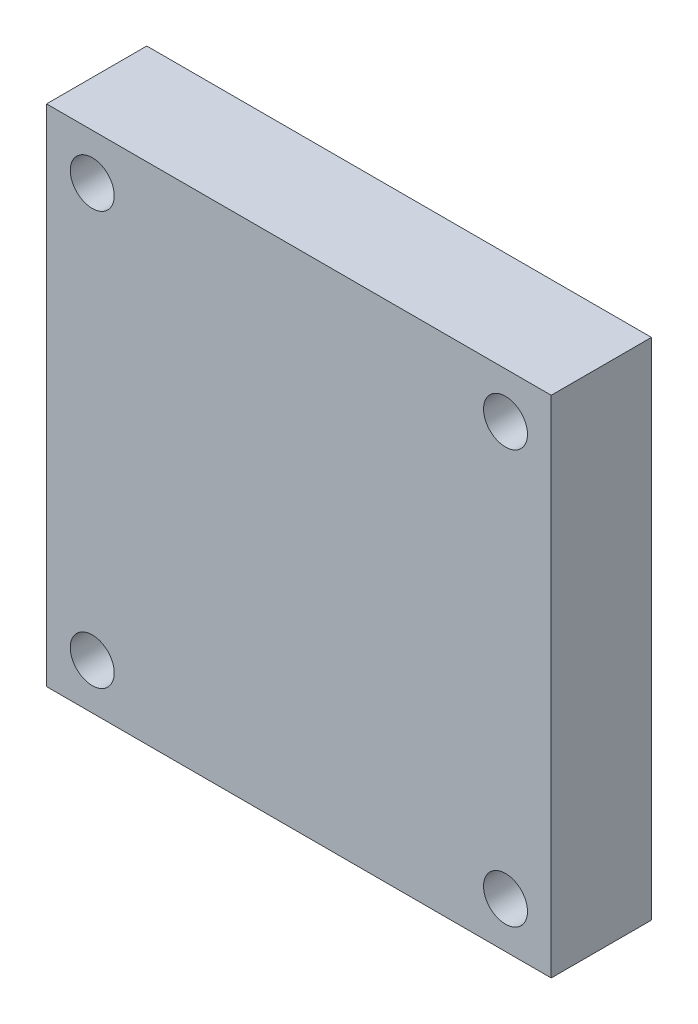
ISO-10303-21;
HEADER;
FILE_DESCRIPTION(('STEP AP214'),'2;1');
FILE_NAME('part.step','',(''),(''),'','','');
FILE_SCHEMA(('AUTOMOTIVE_DESIGN { 1 0 10303 214 1 1 1 1 }'));
ENDSEC;
DATA;
#1=APPLICATION_CONTEXT('core data for automotive mechanical design processes');
#2=APPLICATION_PROTOCOL_DEFINITION('international standard','automotive_design',2000,#1);
#3=PRODUCT_CONTEXT('',#1,'mechanical');
#4=PRODUCT('Part','Part','',(#3));
#5=PRODUCT_RELATED_PRODUCT_CATEGORY('part','',(#4));
#6=PRODUCT_DEFINITION_FORMATION('','',#4);
#7=PRODUCT_DEFINITION_CONTEXT('part definition',#1,'design');
#8=PRODUCT_DEFINITION('design','',#6,#7);
#9=PRODUCT_DEFINITION_SHAPE('','',#8);
#10=(LENGTH_UNIT() NAMED_UNIT(*) SI_UNIT(.MILLI.,.METRE.));
#11=(NAMED_UNIT(*) PLANE_ANGLE_UNIT() SI_UNIT($,.RADIAN.));
#12=(NAMED_UNIT(*) SI_UNIT($,.STERADIAN.) SOLID_ANGLE_UNIT());
#13=UNCERTAINTY_MEASURE_WITH_UNIT(LENGTH_MEASURE(1.E-05),#10,'distance_accuracy_value','');
#14=(GEOMETRIC_REPRESENTATION_CONTEXT(3) GLOBAL_UNCERTAINTY_ASSIGNED_CONTEXT((#13)) GLOBAL_UNIT_ASSIGNED_CONTEXT((#10,
#11,#12)) REPRESENTATION_CONTEXT('',''));
#15=CARTESIAN_POINT('',(0.,0.,0.));
#16=DIRECTION('',(0.,0.,1.));
#17=DIRECTION('',(1.,0.,0.));
#18=AXIS2_PLACEMENT_3D('',#15,#16,#17);
#19=CARTESIAN_POINT('',(28.7,0.,11.4));
#20=DIRECTION('',(-1.,0.,0.));
#21=DIRECTION('',(0.,-1.,0.));
#22=AXIS2_PLACEMENT_3D('',#19,#20,#21);
#23=PLANE('',#22);
#24=DIRECTION('',(0.,1.,0.));
#25=VECTOR('',#24,1.);
#26=CARTESIAN_POINT('',(28.7,0.,0.));
#27=LINE('',#26,#25);
#28=CARTESIAN_POINT('',(28.7,-28.7,0.));
#29=VERTEX_POINT('',#28);
#30=CARTESIAN_POINT('',(28.7,28.7,0.));
#31=VERTEX_POINT('',#30);
#32=EDGE_CURVE('E95',#29,#31,#27,.T.);
#33=ORIENTED_EDGE('',*,*,#32,.T.);
#34=DIRECTION('',(0.,0.,-1.));
#35=VECTOR('',#34,1.);
#36=CARTESIAN_POINT('',(28.7,28.7,11.4));
#37=LINE('',#36,#35);
#38=CARTESIAN_POINT('',(28.7,28.7,11.4));
#39=VERTEX_POINT('',#38);
#40=EDGE_CURVE('E11',#39,#31,#37,.T.);
#41=ORIENTED_EDGE('',*,*,#40,.F.);
#42=DIRECTION('',(0.,1.,0.));
#43=VECTOR('',#42,1.);
#44=CARTESIAN_POINT('',(28.7,0.,11.4));
#45=LINE('',#44,#43);
#46=CARTESIAN_POINT('',(28.7,-28.7,11.4));
#47=VERTEX_POINT('',#46);
#48=EDGE_CURVE('E83',#47,#39,#45,.T.);
#49=ORIENTED_EDGE('',*,*,#48,.F.);
#50=DIRECTION('',(0.,0.,-1.));
#51=VECTOR('',#50,1.);
#52=CARTESIAN_POINT('',(28.7,-28.7,11.4));
#53=LINE('',#52,#51);
#54=EDGE_CURVE('E91',#47,#29,#53,.T.);
#55=ORIENTED_EDGE('',*,*,#54,.T.);
#56=EDGE_LOOP('',(#33,#41,#49,#55));
#57=FACE_BOUND('',#56,.T.);
#58=ADVANCED_FACE('F32',(#57),#23,.F.);
#59=CARTESIAN_POINT('',(0.,28.7,11.4));
#60=DIRECTION('',(0.,-1.,0.));
#61=DIRECTION('',(1.,0.,0.));
#62=AXIS2_PLACEMENT_3D('',#59,#60,#61);
#63=PLANE('',#62);
#64=DIRECTION('',(-1.,0.,0.));
#65=VECTOR('',#64,1.);
#66=CARTESIAN_POINT('',(0.,28.7,0.));
#67=LINE('',#66,#65);
#68=CARTESIAN_POINT('',(-28.7,28.7,0.));
#69=VERTEX_POINT('',#68);
#70=EDGE_CURVE('E87',#31,#69,#67,.T.);
#71=ORIENTED_EDGE('',*,*,#70,.T.);
#72=DIRECTION('',(0.,0.,-1.));
#73=VECTOR('',#72,1.);
#74=CARTESIAN_POINT('',(-28.7,28.7,11.4));
#75=LINE('',#74,#73);
#76=CARTESIAN_POINT('',(-28.7,28.7,11.4));
#77=VERTEX_POINT('',#76);
#78=EDGE_CURVE('E40',#77,#69,#75,.T.);
#79=ORIENTED_EDGE('',*,*,#78,.F.);
#80=DIRECTION('',(-1.,0.,0.));
#81=VECTOR('',#80,1.);
#82=CARTESIAN_POINT('',(0.,28.7,11.4));
#83=LINE('',#82,#81);
#84=EDGE_CURVE('E78',#39,#77,#83,.T.);
#85=ORIENTED_EDGE('',*,*,#84,.F.);
#86=ORIENTED_EDGE('',*,*,#40,.T.);
#87=EDGE_LOOP('',(#71,#79,#85,#86));
#88=FACE_BOUND('',#87,.T.);
#89=ADVANCED_FACE('F86',(#88),#63,.F.);
#90=CARTESIAN_POINT('',(-28.7,0.,11.4));
#91=DIRECTION('',(1.,0.,0.));
#92=DIRECTION('',(0.,0.,-1.));
#93=AXIS2_PLACEMENT_3D('',#90,#91,#92);
#94=PLANE('',#93);
#95=DIRECTION('',(0.,-1.,0.));
#96=VECTOR('',#95,1.);
#97=CARTESIAN_POINT('',(-28.7,0.,0.));
#98=LINE('',#97,#96);
#99=CARTESIAN_POINT('',(-28.7,-28.7,0.));
#100=VERTEX_POINT('',#99);
#101=EDGE_CURVE('E65',#69,#100,#98,.T.);
#102=ORIENTED_EDGE('',*,*,#101,.T.);
#103=DIRECTION('',(0.,0.,-1.));
#104=VECTOR('',#103,1.);
#105=CARTESIAN_POINT('',(-28.7,-28.7,11.4));
#106=LINE('',#105,#104);
#107=CARTESIAN_POINT('',(-28.7,-28.7,11.4));
#108=VERTEX_POINT('',#107);
#109=EDGE_CURVE('E88',#108,#100,#106,.T.);
#110=ORIENTED_EDGE('',*,*,#109,.F.);
#111=DIRECTION('',(0.,-1.,0.));
#112=VECTOR('',#111,1.);
#113=CARTESIAN_POINT('',(-28.7,0.,11.4));
#114=LINE('',#113,#112);
#115=EDGE_CURVE('E81',#77,#108,#114,.T.);
#116=ORIENTED_EDGE('',*,*,#115,.F.);
#117=ORIENTED_EDGE('',*,*,#78,.T.);
#118=EDGE_LOOP('',(#102,#110,#116,#117));
#119=FACE_BOUND('',#118,.T.);
#120=ADVANCED_FACE('F89',(#119),#94,.F.);
#121=CARTESIAN_POINT('',(0.,-28.7,11.4));
#122=DIRECTION('',(0.,1.,0.));
#123=DIRECTION('',(0.,0.,1.));
#124=AXIS2_PLACEMENT_3D('',#121,#122,#123);
#125=PLANE('',#124);
#126=DIRECTION('',(1.,0.,0.));
#127=VECTOR('',#126,1.);
#128=CARTESIAN_POINT('',(0.,-28.7,0.));
#129=LINE('',#128,#127);
#130=EDGE_CURVE('E71',#100,#29,#129,.T.);
#131=ORIENTED_EDGE('',*,*,#130,.T.);
#132=ORIENTED_EDGE('',*,*,#54,.F.);
#133=DIRECTION('',(1.,0.,0.));
#134=VECTOR('',#133,1.);
#135=CARTESIAN_POINT('',(0.,-28.7,11.4));
#136=LINE('',#135,#134);
#137=EDGE_CURVE('E48',#108,#47,#136,.T.);
#138=ORIENTED_EDGE('',*,*,#137,.F.);
#139=ORIENTED_EDGE('',*,*,#109,.T.);
#140=EDGE_LOOP('',(#131,#132,#138,#139));
#141=FACE_BOUND('',#140,.T.);
#142=ADVANCED_FACE('F103',(#141),#125,.F.);
#143=CARTESIAN_POINT('',(0.,0.,11.4));
#144=DIRECTION('',(0.,0.,1.));
#145=DIRECTION('',(1.,0.,0.));
#146=AXIS2_PLACEMENT_3D('',#143,#144,#145);
#147=PLANE('',#146);
#148=CARTESIAN_POINT('',(-23.5,23.5,11.4));
#149=DIRECTION('',(0.,0.,1.));
#150=DIRECTION('',(1.,0.,0.));
#151=AXIS2_PLACEMENT_3D('',#148,#149,#150);
#152=CIRCLE('',#151,2.5);
#153=CARTESIAN_POINT('',(-21.,23.5,11.4));
#154=VERTEX_POINT('',#153);
#155=EDGE_CURVE('E129',#154,#154,#152,.T.);
#156=ORIENTED_EDGE('',*,*,#155,.F.);
#157=EDGE_LOOP('',(#156));
#158=FACE_BOUND('',#157,.T.);
#159=CARTESIAN_POINT('',(23.5,23.5,11.4));
#160=DIRECTION('',(0.,0.,1.));
#161=DIRECTION('',(1.,0.,0.));
#162=AXIS2_PLACEMENT_3D('',#159,#160,#161);
#163=CIRCLE('',#162,2.5);
#164=CARTESIAN_POINT('',(26.,23.5,11.4));
#165=VERTEX_POINT('',#164);
#166=EDGE_CURVE('E123',#165,#165,#163,.T.);
#167=ORIENTED_EDGE('',*,*,#166,.F.);
#168=EDGE_LOOP('',(#167));
#169=FACE_BOUND('',#168,.T.);
#170=CARTESIAN_POINT('',(23.5,-23.5,11.4));
#171=DIRECTION('',(0.,0.,1.));
#172=DIRECTION('',(1.,0.,0.));
#173=AXIS2_PLACEMENT_3D('',#170,#171,#172);
#174=CIRCLE('',#173,2.5);
#175=CARTESIAN_POINT('',(26.,-23.5,11.4));
#176=VERTEX_POINT('',#175);
#177=EDGE_CURVE('E117',#176,#176,#174,.T.);
#178=ORIENTED_EDGE('',*,*,#177,.F.);
#179=EDGE_LOOP('',(#178));
#180=FACE_BOUND('',#179,.T.);
#181=CARTESIAN_POINT('',(-23.5,-23.5,11.4));
#182=DIRECTION('',(0.,0.,1.));
#183=DIRECTION('',(1.,0.,0.));
#184=AXIS2_PLACEMENT_3D('',#181,#182,#183);
#185=CIRCLE('',#184,2.5);
#186=CARTESIAN_POINT('',(-21.,-23.5,11.4));
#187=VERTEX_POINT('',#186);
#188=EDGE_CURVE('E111',#187,#187,#185,.T.);
#189=ORIENTED_EDGE('',*,*,#188,.F.);
#190=EDGE_LOOP('',(#189));
#191=FACE_BOUND('',#190,.T.);
#192=ORIENTED_EDGE('',*,*,#48,.T.);
#193=ORIENTED_EDGE('',*,*,#84,.T.);
#194=ORIENTED_EDGE('',*,*,#115,.T.);
#195=ORIENTED_EDGE('',*,*,#137,.T.);
#196=EDGE_LOOP('',(#192,#193,#194,#195));
#197=FACE_BOUND('',#196,.T.);
#198=ADVANCED_FACE('F79',(#158,#169,#180,#191,#197),#147,.T.);
#199=CARTESIAN_POINT('',(0.,0.,0.));
#200=DIRECTION('',(0.,0.,1.));
#201=DIRECTION('',(1.,0.,0.));
#202=AXIS2_PLACEMENT_3D('',#199,#200,#201);
#203=PLANE('',#202);
#204=CARTESIAN_POINT('',(-23.5,23.5,0.));
#205=DIRECTION('',(0.,0.,1.));
#206=DIRECTION('',(1.,0.,0.));
#207=AXIS2_PLACEMENT_3D('',#204,#205,#206);
#208=CIRCLE('',#207,2.5);
#209=CARTESIAN_POINT('',(-21.,23.5,0.));
#210=VERTEX_POINT('',#209);
#211=EDGE_CURVE('E126',#210,#210,#208,.T.);
#212=ORIENTED_EDGE('',*,*,#211,.T.);
#213=EDGE_LOOP('',(#212));
#214=FACE_BOUND('',#213,.T.);
#215=CARTESIAN_POINT('',(23.5,23.5,0.));
#216=DIRECTION('',(0.,0.,1.));
#217=DIRECTION('',(1.,0.,0.));
#218=AXIS2_PLACEMENT_3D('',#215,#216,#217);
#219=CIRCLE('',#218,2.5);
#220=CARTESIAN_POINT('',(26.,23.5,0.));
#221=VERTEX_POINT('',#220);
#222=EDGE_CURVE('E120',#221,#221,#219,.T.);
#223=ORIENTED_EDGE('',*,*,#222,.T.);
#224=EDGE_LOOP('',(#223));
#225=FACE_BOUND('',#224,.T.);
#226=CARTESIAN_POINT('',(23.5,-23.5,0.));
#227=DIRECTION('',(0.,0.,1.));
#228=DIRECTION('',(1.,0.,0.));
#229=AXIS2_PLACEMENT_3D('',#226,#227,#228);
#230=CIRCLE('',#229,2.5);
#231=CARTESIAN_POINT('',(26.,-23.5,0.));
#232=VERTEX_POINT('',#231);
#233=EDGE_CURVE('E114',#232,#232,#230,.T.);
#234=ORIENTED_EDGE('',*,*,#233,.T.);
#235=EDGE_LOOP('',(#234));
#236=FACE_BOUND('',#235,.T.);
#237=CARTESIAN_POINT('',(-23.5,-23.5,0.));
#238=DIRECTION('',(0.,0.,1.));
#239=DIRECTION('',(1.,0.,0.));
#240=AXIS2_PLACEMENT_3D('',#237,#238,#239);
#241=CIRCLE('',#240,2.5);
#242=CARTESIAN_POINT('',(-21.,-23.5,0.));
#243=VERTEX_POINT('',#242);
#244=EDGE_CURVE('E98',#243,#243,#241,.T.);
#245=ORIENTED_EDGE('',*,*,#244,.T.);
#246=EDGE_LOOP('',(#245));
#247=FACE_BOUND('',#246,.T.);
#248=ORIENTED_EDGE('',*,*,#32,.F.);
#249=ORIENTED_EDGE('',*,*,#130,.F.);
#250=ORIENTED_EDGE('',*,*,#101,.F.);
#251=ORIENTED_EDGE('',*,*,#70,.F.);
#252=EDGE_LOOP('',(#248,#249,#250,#251));
#253=FACE_BOUND('',#252,.T.);
#254=ADVANCED_FACE('F106',(#214,#225,#236,#247,#253),#203,.F.);
#255=CARTESIAN_POINT('',(-23.5,-23.5,11.4));
#256=DIRECTION('',(0.,0.,1.));
#257=DIRECTION('',(1.,0.,0.));
#258=AXIS2_PLACEMENT_3D('',#255,#256,#257);
#259=CYLINDRICAL_SURFACE('',#258,2.5);
#260=ORIENTED_EDGE('',*,*,#244,.F.);
#261=EDGE_LOOP('',(#260));
#262=FACE_BOUND('',#261,.T.);
#263=ORIENTED_EDGE('',*,*,#188,.T.);
#264=EDGE_LOOP('',(#263));
#265=FACE_BOUND('',#264,.T.);
#266=ADVANCED_FACE('F144',(#262,#265),#259,.F.);
#267=CARTESIAN_POINT('',(23.5,-23.5,11.4));
#268=DIRECTION('',(0.,0.,1.));
#269=DIRECTION('',(1.,0.,0.));
#270=AXIS2_PLACEMENT_3D('',#267,#268,#269);
#271=CYLINDRICAL_SURFACE('',#270,2.5);
#272=ORIENTED_EDGE('',*,*,#233,.F.);
#273=EDGE_LOOP('',(#272));
#274=FACE_BOUND('',#273,.T.);
#275=ORIENTED_EDGE('',*,*,#177,.T.);
#276=EDGE_LOOP('',(#275));
#277=FACE_BOUND('',#276,.T.);
#278=ADVANCED_FACE('F146',(#274,#277),#271,.F.);
#279=CARTESIAN_POINT('',(23.5,23.5,11.4));
#280=DIRECTION('',(0.,0.,1.));
#281=DIRECTION('',(1.,0.,0.));
#282=AXIS2_PLACEMENT_3D('',#279,#280,#281);
#283=CYLINDRICAL_SURFACE('',#282,2.5);
#284=ORIENTED_EDGE('',*,*,#222,.F.);
#285=EDGE_LOOP('',(#284));
#286=FACE_BOUND('',#285,.T.);
#287=ORIENTED_EDGE('',*,*,#166,.T.);
#288=EDGE_LOOP('',(#287));
#289=FACE_BOUND('',#288,.T.);
#290=ADVANCED_FACE('F153',(#286,#289),#283,.F.);
#291=CARTESIAN_POINT('',(-23.5,23.5,11.4));
#292=DIRECTION('',(0.,0.,1.));
#293=DIRECTION('',(1.,0.,0.));
#294=AXIS2_PLACEMENT_3D('',#291,#292,#293);
#295=CYLINDRICAL_SURFACE('',#294,2.5);
#296=ORIENTED_EDGE('',*,*,#211,.F.);
#297=EDGE_LOOP('',(#296));
#298=FACE_BOUND('',#297,.T.);
#299=ORIENTED_EDGE('',*,*,#155,.T.);
#300=EDGE_LOOP('',(#299));
#301=FACE_BOUND('',#300,.T.);
#302=ADVANCED_FACE('F133',(#298,#301),#295,.F.);
#303=CLOSED_SHELL('',(#58,#89,#120,#142,#198,#254,#266,#278,#290,#302));
#304=MANIFOLD_SOLID_BREP('B2',#303);
#305=ADVANCED_BREP_SHAPE_REPRESENTATION('',(#18,#304),#14);
#306=SHAPE_DEFINITION_REPRESENTATION(#9,#305);
ENDSEC;
END-ISO-10303-21;
